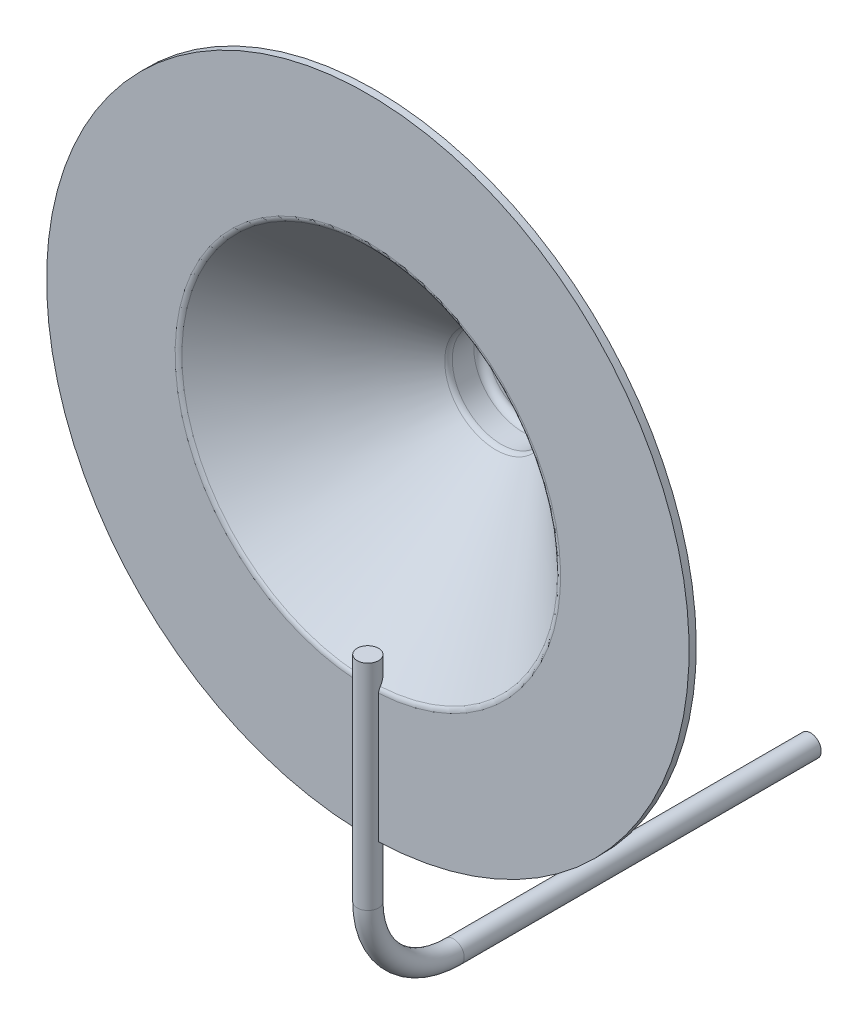
ISO-10303-21;
HEADER;
FILE_DESCRIPTION(('STEP AP214'),'2;1');
FILE_NAME('part.step','',(''),(''),'','','');
FILE_SCHEMA(('AUTOMOTIVE_DESIGN { 1 0 10303 214 1 1 1 1 }'));
ENDSEC;
DATA;
#1=APPLICATION_CONTEXT('core data for automotive mechanical design processes');
#2=APPLICATION_PROTOCOL_DEFINITION('international standard','automotive_design',2000,#1);
#3=PRODUCT_CONTEXT('',#1,'mechanical');
#4=PRODUCT('Part','Part','',(#3));
#5=PRODUCT_RELATED_PRODUCT_CATEGORY('part','',(#4));
#6=PRODUCT_DEFINITION_FORMATION('','',#4);
#7=PRODUCT_DEFINITION_CONTEXT('part definition',#1,'design');
#8=PRODUCT_DEFINITION('design','',#6,#7);
#9=PRODUCT_DEFINITION_SHAPE('','',#8);
#10=(LENGTH_UNIT() NAMED_UNIT(*) SI_UNIT(.MILLI.,.METRE.));
#11=(NAMED_UNIT(*) PLANE_ANGLE_UNIT() SI_UNIT($,.RADIAN.));
#12=(NAMED_UNIT(*) SI_UNIT($,.STERADIAN.) SOLID_ANGLE_UNIT());
#13=UNCERTAINTY_MEASURE_WITH_UNIT(LENGTH_MEASURE(1.E-05),#10,'distance_accuracy_value','');
#14=(GEOMETRIC_REPRESENTATION_CONTEXT(3) GLOBAL_UNCERTAINTY_ASSIGNED_CONTEXT((#13)) GLOBAL_UNIT_ASSIGNED_CONTEXT((#10,
#11,#12)) REPRESENTATION_CONTEXT('',''));
#15=CARTESIAN_POINT('',(0.,0.,0.));
#16=DIRECTION('',(0.,0.,1.));
#17=DIRECTION('',(1.,0.,0.));
#18=AXIS2_PLACEMENT_3D('',#15,#16,#17);
#19=CARTESIAN_POINT('',(0.,-5.3,6.19999999999999));
#20=DIRECTION('',(0.,1.,0.));
#21=DIRECTION('',(0.,0.,1.));
#22=AXIS2_PLACEMENT_3D('',#19,#20,#21);
#23=CYLINDRICAL_SURFACE('',#22,0.15);
#24=CARTESIAN_POINT('',(0.,-4.5,6.34999999999999));
#25=CARTESIAN_POINT('',(0.00842305578923469,-4.4999999663489,6.34999962724313));
#26=CARTESIAN_POINT('',(0.0168521595123221,-4.49997609706395,6.34928813968072));
#27=CARTESIAN_POINT('',(0.0334780529122563,-4.49988317240277,6.34645984425193));
#28=CARTESIAN_POINT('',(0.0416745534213969,-4.49981406314987,6.34434136073797));
#29=CARTESIAN_POINT('',(0.0575919781000059,-4.49963848440692,6.33875960317438));
#30=CARTESIAN_POINT('',(0.0653131340412636,-4.4995320332966,6.33529699061854));
#31=CARTESIAN_POINT('',(0.0800624366854199,-4.49929377585201,6.32712622374));
#32=CARTESIAN_POINT('',(0.0870907512542427,-4.49916197568241,6.32241837214475));
#33=CARTESIAN_POINT('',(0.100260735292938,-4.49888778082419,6.3118878815052));
#34=CARTESIAN_POINT('',(0.106402003146471,-4.49874538138061,6.30606474026404));
#35=CARTESIAN_POINT('',(0.117620176399931,-4.49846607902012,6.29346987595953));
#36=CARTESIAN_POINT('',(0.122697039268723,-4.49832917632302,6.28669811500959));
#37=CARTESIAN_POINT('',(0.131643038257708,-4.49807627946864,6.27239658938628));
#38=CARTESIAN_POINT('',(0.135511915044493,-4.49796028980329,6.26486666240621));
#39=CARTESIAN_POINT('',(0.14193043803754,-4.49776234602747,6.24926370478984));
#40=CARTESIAN_POINT('',(0.144480090156492,-4.49768039176448,6.24119067658788));
#41=CARTESIAN_POINT('',(0.14818687531237,-4.49755979665162,6.22473388130418));
#42=CARTESIAN_POINT('',(0.149344529609131,-4.49752113958868,6.21635023175352));
#43=CARTESIAN_POINT('',(0.150236063891772,-4.49749144895794,6.19950751076078));
#44=CARTESIAN_POINT('',(0.149969950293232,-4.49750041517554,6.19104843965873));
#45=CARTESIAN_POINT('',(0.148021941870991,-4.49756494491055,6.17429853427805));
#46=CARTESIAN_POINT('',(0.146340610333705,-4.4976204898886,6.16600763440809));
#47=CARTESIAN_POINT('',(0.141610764489337,-4.49777188653597,6.14982582985754));
#48=CARTESIAN_POINT('',(0.138562246806203,-4.49786773830482,6.14193492616472));
#49=CARTESIAN_POINT('',(0.131183918840239,-4.4980889649087,6.12677529463673));
#50=CARTESIAN_POINT('',(0.126853850547168,-4.49821434568766,6.11950669246771));
#51=CARTESIAN_POINT('',(0.117035527130669,-4.49848049027993,6.10579937101495));
#52=CARTESIAN_POINT('',(0.111547268631008,-4.49862125413808,6.09936065415049));
#53=CARTESIAN_POINT('',(0.0995651710942693,-4.49890237949121,6.0874925940333));
#54=CARTESIAN_POINT('',(0.0930708437376427,-4.49904274075692,6.08206374377458));
#55=CARTESIAN_POINT('',(0.0792626805756575,-4.4993071722234,6.07237331847266));
#56=CARTESIAN_POINT('',(0.0719488446300602,-4.4994312424214,6.06811174362922));
#57=CARTESIAN_POINT('',(0.0567090019492417,-4.49964910828733,6.06087689403778));
#58=CARTESIAN_POINT('',(0.0487829877417193,-4.49974290358567,6.057903635018));
#59=CARTESIAN_POINT('',(0.0325439037182619,-4.49988964095379,6.05333013301318));
#60=CARTESIAN_POINT('',(0.0242308351991917,-4.49994258316045,6.05172988542808));
#61=CARTESIAN_POINT('',(0.0074579041642934,-4.50000162910169,6.04994843615438));
#62=CARTESIAN_POINT('',(-0.00100188582888631,-4.50000775535074,6.04976655235354));
#63=CARTESIAN_POINT('',(-0.017831878784369,-4.49997253847829,6.05082521577816));
#64=CARTESIAN_POINT('',(-0.0262020818758181,-4.49993119542525,6.05206576095279));
#65=CARTESIAN_POINT('',(-0.0426133978818143,-4.49980571349223,6.05593350317637));
#66=CARTESIAN_POINT('',(-0.0506545839209891,-4.49972158417803,6.05856039028469));
#67=CARTESIAN_POINT('',(-0.0661818515011233,-4.49952000872159,6.06512593405327));
#68=CARTESIAN_POINT('',(-0.0736679316506717,-4.49940256249584,6.06906459400146));
#69=CARTESIAN_POINT('',(-0.087875623242016,-4.49914752515382,6.0781436342119));
#70=CARTESIAN_POINT('',(-0.0945969413405672,-4.49900992635351,6.08328447330488));
#71=CARTESIAN_POINT('',(-0.10708136842188,-4.49873011542475,6.0946212688419));
#72=CARTESIAN_POINT('',(-0.112844474470415,-4.49858790328218,6.10081722851679));
#73=CARTESIAN_POINT('',(-0.123251164011961,-4.49831483319105,6.11409130895656));
#74=CARTESIAN_POINT('',(-0.127894307221744,-4.49818397972076,6.1211697750017));
#75=CARTESIAN_POINT('',(-0.135926259433925,-4.49794845086808,6.13600617727003));
#76=CARTESIAN_POINT('',(-0.139315071611855,-4.49784377541943,6.14376411177297));
#77=CARTESIAN_POINT('',(-0.144741394651816,-4.4976724367805,6.15973757748002));
#78=CARTESIAN_POINT('',(-0.146779189838392,-4.49760576559255,6.16795301200747));
#79=CARTESIAN_POINT('',(-0.149446565063327,-4.49751793017976,6.18460963843641));
#80=CARTESIAN_POINT('',(-0.150076147229453,-4.49749676588617,6.19305082999678));
#81=CARTESIAN_POINT('',(-0.149909192637936,-4.49750233338375,6.20991495508831));
#82=CARTESIAN_POINT('',(-0.149113349841437,-4.4975290418683,6.21833789550626));
#83=CARTESIAN_POINT('',(-0.146119564957647,-4.49762729507843,6.23493053810348));
#84=CARTESIAN_POINT('',(-0.143921620102458,-4.49769883989251,6.2431002397828));
#85=CARTESIAN_POINT('',(-0.138186130366784,-4.49787869671532,6.25895473131229));
#86=CARTESIAN_POINT('',(-0.134648564184163,-4.49798700930871,6.26663951344918));
#87=CARTESIAN_POINT('',(-0.126334454498309,-4.49822818732174,6.28130596285721));
#88=CARTESIAN_POINT('',(-0.121557954901244,-4.49836105187125,6.28828765503276));
#89=CARTESIAN_POINT('',(-0.110899391645607,-4.49863642406369,6.30135301056789));
#90=CARTESIAN_POINT('',(-0.105016908489365,-4.49877893535246,6.30743633160847));
#91=CARTESIAN_POINT('',(-0.0923124370152846,-4.49905753400846,6.31853076644203));
#92=CARTESIAN_POINT('',(-0.0854902166260294,-4.49919361977771,6.32354161460101));
#93=CARTESIAN_POINT('',(-0.0710969086078195,-4.49944408112954,6.33234990985486));
#94=CARTESIAN_POINT('',(-0.0635253084790552,-4.49955844169603,6.33614651891896));
#95=CARTESIAN_POINT('',(-0.047857599747668,-4.4997523012651,6.34241020428075));
#96=CARTESIAN_POINT('',(-0.039762128777033,-4.49983184176597,6.34487886402614));
#97=CARTESIAN_POINT('',(-0.0263463576588846,-4.49992586926896,6.3477632370994));
#98=CARTESIAN_POINT('',(-0.0211131135613521,-4.49995354747019,6.34860096573659));
#99=CARTESIAN_POINT('',(-0.0105873762627153,-4.49999062340921,6.34971946424585));
#100=CARTESIAN_POINT('',(-0.0052948830832799,-4.50000002115368,6.35000023432161));
#101=CARTESIAN_POINT('',(0.,-4.5,6.34999999999999));
#102=B_SPLINE_CURVE_WITH_KNOTS('',3,(#24,#25,#26,#27,#28,#29,#30,#31,#32,#33,#34,#35,#36,#37,
#38,#39,#40,#41,#42,#43,#44,#45,#46,#47,#48,#49,#50,#51,#52,#53,#54,#55,#56,#57,#58,#59,#60,#61,
#62,#63,#64,#65,#66,#67,#68,#69,#70,#71,#72,#73,#74,#75,#76,#77,#78,#79,#80,#81,#82,#83,#84,#85,
#86,#87,#88,#89,#90,#91,#92,#93,#94,#95,#96,#97,#98,#99,#100,#101),.UNSPECIFIED.,.T.,.F.,(4,2,2,
2,2,2,2,2,2,2,2,2,2,2,2,2,2,2,2,2,2,2,2,2,2,2,2,2,2,2,2,2,2,2,2,2,2,2,4),(0.,0.0252498401882614,
0.050529805470018,0.075797345320868,0.10105874807005,0.126331552476644,0.151605366533064,
0.17688460270899,0.202163725583854,0.227433379263464,0.252702919076677,0.277962405836567,
0.303221954971138,0.328486592988428,0.353751304655501,0.37902831779896,0.404305335267964,
0.429582661319222,0.454859902682321,0.480124987094063,0.505390035079432,0.530649437018977,
0.555908902270803,0.581178023978172,0.606447223062961,0.631726339921331,0.657005392781315,
0.682279123917965,0.707552816866738,0.73281420878652,0.758075650575135,0.783337494078242,
0.808598442457161,0.833868991671109,0.859145792761928,0.884440001670267,0.909703982510625,
0.925576488155589,0.941448987995756),.UNSPECIFIED.);
#103=CARTESIAN_POINT('',(0.15,-4.49749930516948,6.19999999999999));
#104=VERTEX_POINT('',#103);
#105=CARTESIAN_POINT('',(0.11180339887499,-4.49861089671023,6.09999999999999));
#106=VERTEX_POINT('',#105);
#107=EDGE_CURVE('E11',#104,#106,#102,.T.);
#108=ORIENTED_EDGE('',*,*,#107,.F.);
#109=DIRECTION('',(0.,1.,0.));
#110=VECTOR('',#109,1.);
#111=CARTESIAN_POINT('',(0.15,-5.3,6.19999999999999));
#112=LINE('',#111,#110);
#113=CARTESIAN_POINT('',(0.15,-2.69583011334171,6.19999999999999));
#114=VERTEX_POINT('',#113);
#115=EDGE_CURVE('E169',#114,#104,#112,.F.);
#116=ORIENTED_EDGE('',*,*,#115,.F.);
#117=CARTESIAN_POINT('',(0.147592454675923,-2.62776349245829,6.17323309276857));
#118=CARTESIAN_POINT('',(0.148260648346117,-2.63170876049585,6.17693871212926));
#119=CARTESIAN_POINT('',(0.148732730797178,-2.63598076420099,6.18031677264153));
#120=CARTESIAN_POINT('',(0.149407771591125,-2.64503045876261,6.18633296389364));
#121=CARTESIAN_POINT('',(0.149611056526367,-2.64980752831836,6.18897198949));
#122=CARTESIAN_POINT('',(0.149872484898582,-2.65972453716036,6.19343231181264));
#123=CARTESIAN_POINT('',(0.14993078378246,-2.66486408173148,6.19525448261004));
#124=CARTESIAN_POINT('',(0.149994260827242,-2.67536514778347,6.19803975796262));
#125=CARTESIAN_POINT('',(0.149999498326573,-2.68072641457174,6.19900382103654));
#126=CARTESIAN_POINT('',(0.14999905964575,-2.69080390358621,6.19998491550968));
#127=CARTESIAN_POINT('',(0.149994759754331,-2.6955096331253,6.20011211012248));
#128=CARTESIAN_POINT('',(0.149999969770463,-2.70019999999998,6.19990476939652));
#129=B_SPLINE_CURVE_WITH_KNOTS('',3,(#117,#118,#119,#120,#121,#122,#123,#124,#125,#126,#127,
#128),.UNSPECIFIED.,.F.,.F.,(4,2,2,2,2,4),(0.,0.0163247398510532,0.0326296266565771,
0.0489170246143126,0.0651862063980188,0.0792617964111007),.UNSPECIFIED.);
#130=CARTESIAN_POINT('',(0.147628586120579,-2.62797752969163,6.17343309275925));
#131=VERTEX_POINT('',#130);
#132=EDGE_CURVE('E99',#131,#114,#129,.T.);
#133=ORIENTED_EDGE('',*,*,#132,.F.);
#134=CARTESIAN_POINT('',(-0.149343023608144,-2.64147205449942,6.18597640204592));
#135=CARTESIAN_POINT('',(-0.148257481932023,-2.6293126941027,6.17470378552663));
#136=CARTESIAN_POINT('',(-0.145924349391535,-2.61717578070323,6.16337591005817));
#137=CARTESIAN_POINT('',(-0.138413604644136,-2.59330106192299,6.14095791068932));
#138=CARTESIAN_POINT('',(-0.133201282196265,-2.58157002082887,6.12987243904061));
#139=CARTESIAN_POINT('',(-0.122214890865073,-2.56349726305133,6.11268879442249));
#140=CARTESIAN_POINT('',(-0.117430635767246,-2.55682024285901,6.10631438866371));
#141=CARTESIAN_POINT('',(-0.106559085727574,-2.54408705358876,6.09411455684));
#142=CARTESIAN_POINT('',(-0.100476784108048,-2.53802863332228,6.08828714690919));
#143=CARTESIAN_POINT('',(-0.0884561028701566,-2.52806386760671,6.07867158351688));
#144=CARTESIAN_POINT('',(-0.0827962257170654,-2.52398067630688,6.074720283253));
#145=CARTESIAN_POINT('',(-0.0706378081625269,-2.51652007570977,6.0674852296196));
#146=CARTESIAN_POINT('',(-0.0641401048358653,-2.51314197066332,6.06420081828029));
#147=CARTESIAN_POINT('',(-0.0517121985635129,-2.50787089745336,6.05906771247288));
#148=CARTESIAN_POINT('',(-0.045914753206457,-2.50581710542551,6.05706424392605));
#149=CARTESIAN_POINT('',(-0.0339226162333526,-2.50242685283714,6.05375416162696));
#150=CARTESIAN_POINT('',(-0.0277282054880401,-2.50108989122568,6.05244706113064));
#151=CARTESIAN_POINT('',(-0.0150685123783346,-2.49922299819053,6.05062122672329));
#152=CARTESIAN_POINT('',(-0.00860198324392683,-2.49869732229806,6.05010664995781));
#153=CARTESIAN_POINT('',(0.0043552042929747,-2.49851008555425,6.04992341008355));
#154=CARTESIAN_POINT('',(0.0108458577842335,-2.49884835751308,6.05025458330658));
#155=CARTESIAN_POINT('',(0.0230965213498389,-2.50029657615518,6.05167128236637));
#156=CARTESIAN_POINT('',(0.0288723596648218,-2.50133990354351,6.05269168090871));
#157=CARTESIAN_POINT('',(0.0401225562490682,-2.50406087653368,6.05534992888236));
#158=CARTESIAN_POINT('',(0.0455968040067812,-2.50573875290475,6.05698800294581));
#159=CARTESIAN_POINT('',(0.0577859507705718,-2.51024683640637,6.06138279622013));
#160=CARTESIAN_POINT('',(0.0643600443709466,-2.51327298721011,6.06432884436633));
#161=CARTESIAN_POINT('',(0.0767312206122429,-2.52005937010196,6.07091984656736));
#162=CARTESIAN_POINT('',(0.0825269686642201,-2.52382083655722,6.0745659756554));
#163=CARTESIAN_POINT('',(0.0953128577493477,-2.53338966874653,6.08381650566497));
#164=CARTESIAN_POINT('',(0.101956015546936,-2.53944014691157,6.0896473901399));
#165=CARTESIAN_POINT('',(0.113829633985528,-2.55224532787521,6.10193822839228));
#166=CARTESIAN_POINT('',(0.119057041563311,-2.55900150975549,6.10839950145204));
#167=CARTESIAN_POINT('',(0.130091438750021,-2.57586415646814,6.12445942409624));
#168=CARTESIAN_POINT('',(0.135251517330301,-2.58620508054889,6.13425486143364));
#169=CARTESIAN_POINT('',(0.143241265130115,-2.60738729889181,6.1542024557933));
#170=CARTESIAN_POINT('',(0.146072116816615,-2.61822833630815,6.1643544290819));
#171=CARTESIAN_POINT('',(0.148479886629033,-2.6332650908433,6.17835730655679));
#172=CARTESIAN_POINT('',(0.148984086060253,-2.63736443883716,6.18216696640583));
#173=CARTESIAN_POINT('',(0.149343023608145,-2.64147205449942,6.18597640204592));
#174=B_SPLINE_CURVE_WITH_KNOTS('',3,(#134,#135,#136,#137,#138,#139,#140,#141,#142,#143,#144,
#145,#146,#147,#148,#149,#150,#151,#152,#153,#154,#155,#156,#157,#158,#159,#160,#161,#162,#163,
#164,#165,#166,#167,#168,#169,#170,#171,#172,#173),.UNSPECIFIED.,.F.,.F.,(4,2,2,2,2,2,2,2,2,2,2,
2,2,2,2,2,2,2,2,4),(0.,0.0499716216561541,0.100559259111792,0.131660210852275,0.16264361324885,
0.186620377425872,0.210573369315285,0.229900322083233,0.249213748005489,0.268628140650761,
0.288038776538047,0.305832704342108,0.323633109574702,0.346946114899063,0.370298596911756,
0.402257222718973,0.434284228194368,0.479492414055909,0.524677635118706,0.541524840105466),.UNSPECIFIED.);
#175=CARTESIAN_POINT('',(-0.147628586121588,-2.62797752969785,6.17343309276838));
#176=VERTEX_POINT('',#175);
#177=EDGE_CURVE('E81',#176,#131,#174,.T.);
#178=ORIENTED_EDGE('',*,*,#177,.F.);
#179=CARTESIAN_POINT('',(-0.149999969770437,-2.7002,6.1999047693963));
#180=CARTESIAN_POINT('',(-0.149990932883973,-2.69459886091882,6.20015359116287));
#181=CARTESIAN_POINT('',(-0.149999141454605,-2.68897782076842,6.19992387525168));
#182=CARTESIAN_POINT('',(-0.149996889947737,-2.67783887890871,6.19853191549922));
#183=CARTESIAN_POINT('',(-0.149986386181456,-2.67232124903959,6.19736749283208));
#184=CARTESIAN_POINT('',(-0.149893045233185,-2.66155402033728,6.19412802925226));
#185=CARTESIAN_POINT('',(-0.149810131460046,-2.65630471154398,6.1920520252776));
#186=CARTESIAN_POINT('',(-0.149461146474099,-2.64624959978622,6.18705056052545));
#187=CARTESIAN_POINT('',(-0.149195620633867,-2.64144252442324,6.18412764406092));
#188=CARTESIAN_POINT('',(-0.148466854008081,-2.63371541053077,6.17848134865159));
#189=CARTESIAN_POINT('',(-0.14808266301025,-2.63065083520647,6.17594329735243));
#190=CARTESIAN_POINT('',(-0.147592454676046,-2.6277634924584,6.17323309276841));
#191=B_SPLINE_CURVE_WITH_KNOTS('',3,(#179,#180,#181,#182,#183,#184,#185,#186,#187,#188,#189,
#190),.UNSPECIFIED.,.F.,.F.,(4,2,2,2,2,4),(0.,0.0167987571364454,0.0336367867239368,
0.0504926482137955,0.0672983868876986,0.079260042560122),.UNSPECIFIED.);
#192=CARTESIAN_POINT('',(-0.15,-2.69583011334171,6.19999999999999));
#193=VERTEX_POINT('',#192);
#194=EDGE_CURVE('E75',#193,#176,#191,.T.);
#195=ORIENTED_EDGE('',*,*,#194,.F.);
#196=DIRECTION('',(0.,1.,0.));
#197=VECTOR('',#196,1.);
#198=CARTESIAN_POINT('',(-0.15,-5.3,6.19999999999999));
#199=LINE('',#198,#197);
#200=CARTESIAN_POINT('',(-0.15,-4.49749930516948,6.19999999999999));
#201=VERTEX_POINT('',#200);
#202=EDGE_CURVE('E78',#201,#193,#199,.T.);
#203=ORIENTED_EDGE('',*,*,#202,.F.);
#204=CARTESIAN_POINT('',(-0.111803398874994,-4.49861089671023,6.09999999999999));
#205=VERTEX_POINT('',#204);
#206=EDGE_CURVE('E42',#205,#201,#102,.T.);
#207=ORIENTED_EDGE('',*,*,#206,.F.);
#208=DIRECTION('',(0.,1.,0.));
#209=VECTOR('',#208,1.);
#210=CARTESIAN_POINT('',(-0.11180339887499,-5.3,6.09999999999999));
#211=LINE('',#210,#209);
#212=CARTESIAN_POINT('',(-0.11180339887499,-2.69768419204324,6.09999999999999));
#213=VERTEX_POINT('',#212);
#214=EDGE_CURVE('E163',#213,#205,#211,.F.);
#215=ORIENTED_EDGE('',*,*,#214,.F.);
#216=CARTESIAN_POINT('',(0.116245257967799,-2.70312711771821,6.10519999999999));
#217=CARTESIAN_POINT('',(0.111508410263343,-2.69704335282468,6.09939457031248));
#218=CARTESIAN_POINT('',(0.106191207346347,-2.691163531819,6.09376248858668));
#219=CARTESIAN_POINT('',(0.0942959076086731,-2.68003005930324,6.08306732653731));
#220=CARTESIAN_POINT('',(0.0877046148167213,-2.67478398699131,6.07801116825454));
#221=CARTESIAN_POINT('',(0.0751315014855339,-2.66651149182841,6.07001783184854));
#222=CARTESIAN_POINT('',(0.0694332537194209,-2.66326196324069,6.06687088110914));
#223=CARTESIAN_POINT('',(0.0573997587510783,-2.65747591706972,6.06125895065075));
#224=CARTESIAN_POINT('',(0.0510672445068236,-2.65493650520729,6.05879120331676));
#225=CARTESIAN_POINT('',(0.0388320611657511,-2.65103264869694,6.05499359000535));
#226=CARTESIAN_POINT('',(0.0330027291344942,-2.64955045247115,6.0535498719421));
#227=CARTESIAN_POINT('',(0.021074431392455,-2.64730765434864,6.05136427494578));
#228=CARTESIAN_POINT('',(0.0149754375026845,-2.64654712805202,6.05062246954313));
#229=CARTESIAN_POINT('',(0.00266989156005454,-2.64580324885016,6.04989690918266));
#230=CARTESIAN_POINT('',(-0.00353687969067115,-2.64582172766907,6.04991494087798));
#231=CARTESIAN_POINT('',(-0.015848189742385,-2.64663894358602,6.05071201576891));
#232=CARTESIAN_POINT('',(-0.0219527237053316,-2.64743771750341,6.05149109487567));
#233=CARTESIAN_POINT('',(-0.0336597450694292,-2.64971327505532,6.05370846116419));
#234=CARTESIAN_POINT('',(-0.0392724785801995,-2.65116344473811,6.05512086894645));
#235=CARTESIAN_POINT('',(-0.0501306165698138,-2.6546478257337,6.05851033630297));
#236=CARTESIAN_POINT('',(-0.0553759220625383,-2.65668219368413,6.06048754731384));
#237=CARTESIAN_POINT('',(-0.0674871845655642,-2.66217315474118,6.06581615390628));
#238=CARTESIAN_POINT('',(-0.0741416537037785,-2.66587140606292,6.06939912195071));
#239=CARTESIAN_POINT('',(-0.0865394058070578,-2.67400636419898,6.07726000408673));
#240=CARTESIAN_POINT('',(-0.0922799355042373,-2.67844522282048,6.08153994230436));
#241=CARTESIAN_POINT('',(-0.101081003097445,-2.68628348159451,6.08907622120694));
#242=CARTESIAN_POINT('',(-0.104396066464006,-2.68953454407121,6.09219667091797));
#243=CARTESIAN_POINT('',(-0.110615189482238,-2.69620826438898,6.09859013212888));
#244=CARTESIAN_POINT('',(-0.113522001896369,-2.6996295389706,6.10186190219225));
#245=CARTESIAN_POINT('',(-0.116245257968039,-2.70312711771808,6.10519999999986));
#246=B_SPLINE_CURVE_WITH_KNOTS('',3,(#216,#217,#218,#219,#220,#221,#222,#223,#224,#225,#226,
#227,#228,#229,#230,#231,#232,#233,#234,#235,#236,#237,#238,#239,#240,#241,#242,#243,#244,#245),
.UNSPECIFIED.,.F.,.F.,(4,2,2,2,2,2,2,2,2,2,2,2,2,2,4),(0.,0.0290176757476346,0.0583537728358914,
0.0800994022780507,0.101755064739514,0.120232113360398,0.138711097371111,0.157233534607547,
0.175756845894448,0.193583893706585,0.211415725849439,0.23651998873098,0.261698503529203,
0.278463009586152,0.295108407104796),.UNSPECIFIED.);
#247=CARTESIAN_POINT('',(0.111803398875002,-2.69768419204324,6.1));
#248=VERTEX_POINT('',#247);
#249=EDGE_CURVE('E52',#248,#213,#246,.T.);
#250=ORIENTED_EDGE('',*,*,#249,.F.);
#251=DIRECTION('',(0.,1.,0.));
#252=VECTOR('',#251,1.);
#253=CARTESIAN_POINT('',(0.11180339887499,-5.3,6.09999999999999));
#254=LINE('',#253,#252);
#255=EDGE_CURVE('E36',#106,#248,#254,.T.);
#256=ORIENTED_EDGE('',*,*,#255,.F.);
#257=EDGE_LOOP('',(#108,#116,#133,#178,#195,#203,#207,#215,#250,#256));
#258=FACE_BOUND('',#257,.T.);
#259=CARTESIAN_POINT('',(0.,-5.3,6.19999999999999));
#260=DIRECTION('',(0.,1.,0.));
#261=DIRECTION('',(1.,0.,0.));
#262=AXIS2_PLACEMENT_3D('',#259,#260,#261);
#263=CIRCLE('',#262,0.15);
#264=CARTESIAN_POINT('',(0.,-5.3,6.34999999999999));
#265=VERTEX_POINT('',#264);
#266=EDGE_CURVE('E136',#265,#265,#263,.T.);
#267=ORIENTED_EDGE('',*,*,#266,.T.);
#268=EDGE_LOOP('',(#267));
#269=FACE_BOUND('',#268,.T.);
#270=CARTESIAN_POINT('',(0.,-2.3,6.19999999999999));
#271=DIRECTION('',(0.,1.,0.));
#272=DIRECTION('',(1.,0.,0.));
#273=AXIS2_PLACEMENT_3D('',#270,#271,#272);
#274=CIRCLE('',#273,0.15);
#275=CARTESIAN_POINT('',(0.15,-2.3,6.19999999999999));
#276=VERTEX_POINT('',#275);
#277=EDGE_CURVE('E95',#276,#276,#274,.T.);
#278=ORIENTED_EDGE('',*,*,#277,.F.);
#279=EDGE_LOOP('',(#278));
#280=FACE_BOUND('',#279,.T.);
#281=ADVANCED_FACE('F32',(#258,#269,#280),#23,.T.);
#282=CARTESIAN_POINT('',(0.,-5.3,4.99999999999999));
#283=DIRECTION('',(-1.,0.,0.));
#284=DIRECTION('',(0.,0.,1.));
#285=AXIS2_PLACEMENT_3D('',#282,#283,#284);
#286=TOROIDAL_SURFACE('',#285,1.2,0.15);
#287=CARTESIAN_POINT('',(0.,-6.5,4.99999999999999));
#288=DIRECTION('',(0.,0.,1.));
#289=DIRECTION('',(1.,0.,0.));
#290=AXIS2_PLACEMENT_3D('',#287,#288,#289);
#291=CIRCLE('',#290,0.15);
#292=CARTESIAN_POINT('',(0.,-6.65,4.99999999999999));
#293=VERTEX_POINT('',#292);
#294=EDGE_CURVE('E133',#293,#293,#291,.T.);
#295=CARTESIAN_POINT('',(0.,-5.3,4.99999999999999));
#296=DIRECTION('',(-1.,0.,0.));
#297=DIRECTION('',(0.,0.,1.));
#298=AXIS2_PLACEMENT_3D('',#295,#296,#297);
#299=CIRCLE('',#298,1.35);
#300=EDGE_CURVE('',#293,#265,#299,.T.);
#301=ORIENTED_EDGE('',*,*,#294,.T.);
#302=ORIENTED_EDGE('',*,*,#266,.F.);
#303=ORIENTED_EDGE('',*,*,#300,.T.);
#304=ORIENTED_EDGE('',*,*,#300,.F.);
#305=EDGE_LOOP('',(#301,#303,#302,#304));
#306=FACE_BOUND('',#305,.T.);
#307=ADVANCED_FACE('F200',(#306),#286,.T.);
#308=CARTESIAN_POINT('',(0.,-6.5,4.99999999999999));
#309=DIRECTION('',(0.,0.,-1.));
#310=DIRECTION('',(-1.,0.,0.));
#311=AXIS2_PLACEMENT_3D('',#308,#309,#310);
#312=CYLINDRICAL_SURFACE('',#311,0.15);
#313=ORIENTED_EDGE('',*,*,#294,.F.);
#314=EDGE_LOOP('',(#313));
#315=FACE_BOUND('',#314,.T.);
#316=CARTESIAN_POINT('',(0.,-6.5,0.));
#317=DIRECTION('',(0.,0.,1.));
#318=DIRECTION('',(1.,0.,0.));
#319=AXIS2_PLACEMENT_3D('',#316,#317,#318);
#320=CIRCLE('',#319,0.15);
#321=CARTESIAN_POINT('',(0.15,-6.5,0.));
#322=VERTEX_POINT('',#321);
#323=EDGE_CURVE('E132',#322,#322,#320,.T.);
#324=ORIENTED_EDGE('',*,*,#323,.T.);
#325=EDGE_LOOP('',(#324));
#326=FACE_BOUND('',#325,.T.);
#327=ADVANCED_FACE('F194',(#315,#326),#312,.T.);
#328=CARTESIAN_POINT('',(0.,-2.3,6.19999999999999));
#329=DIRECTION('',(0.,1.,0.));
#330=DIRECTION('',(1.,0.,0.));
#331=AXIS2_PLACEMENT_3D('',#328,#329,#330);
#332=PLANE('',#331);
#333=ORIENTED_EDGE('',*,*,#277,.T.);
#334=EDGE_LOOP('',(#333));
#335=FACE_BOUND('',#334,.T.);
#336=ADVANCED_FACE('F191',(#335),#332,.T.);
#337=CARTESIAN_POINT('',(0.,-6.5,0.));
#338=DIRECTION('',(0.,0.,1.));
#339=DIRECTION('',(1.,0.,0.));
#340=AXIS2_PLACEMENT_3D('',#337,#338,#339);
#341=PLANE('',#340);
#342=ORIENTED_EDGE('',*,*,#323,.F.);
#343=EDGE_LOOP('',(#342));
#344=FACE_BOUND('',#343,.T.);
#345=ADVANCED_FACE('F189',(#344),#341,.F.);
#346=CARTESIAN_POINT('',(0.,0.,6.19999999999999));
#347=DIRECTION('',(0.,0.,1.));
#348=DIRECTION('',(1.,0.,0.));
#349=AXIS2_PLACEMENT_3D('',#346,#347,#348);
#350=CYLINDRICAL_SURFACE('',#349,4.5);
#351=CARTESIAN_POINT('',(0.,0.,6.19999999999999));
#352=DIRECTION('',(0.,0.,1.));
#353=DIRECTION('',(1.,0.,0.));
#354=AXIS2_PLACEMENT_3D('',#351,#352,#353);
#355=CIRCLE('',#354,4.5);
#356=EDGE_CURVE('E94',#104,#201,#355,.T.);
#357=ORIENTED_EDGE('',*,*,#356,.F.);
#358=ORIENTED_EDGE('',*,*,#107,.T.);
#359=CARTESIAN_POINT('',(0.,0.,6.09999999999999));
#360=DIRECTION('',(0.,0.,1.));
#361=DIRECTION('',(1.,0.,0.));
#362=AXIS2_PLACEMENT_3D('',#359,#360,#361);
#363=CIRCLE('',#362,4.5);
#364=EDGE_CURVE('E129',#106,#205,#363,.T.);
#365=ORIENTED_EDGE('',*,*,#364,.T.);
#366=ORIENTED_EDGE('',*,*,#206,.T.);
#367=EDGE_LOOP('',(#357,#358,#365,#366));
#368=FACE_BOUND('',#367,.T.);
#369=ADVANCED_FACE('F184',(#368),#350,.T.);
#370=CARTESIAN_POINT('',(0.,-4.5,6.09999999999999));
#371=DIRECTION('',(0.,0.,-1.));
#372=DIRECTION('',(-1.,0.,0.));
#373=AXIS2_PLACEMENT_3D('',#370,#371,#372);
#374=PLANE('',#373);
#375=CARTESIAN_POINT('',(0.,0.,6.09999999999999));
#376=DIRECTION('',(0.,0.,1.));
#377=DIRECTION('',(1.,0.,0.));
#378=AXIS2_PLACEMENT_3D('',#375,#376,#377);
#379=CIRCLE('',#378,2.7);
#380=EDGE_CURVE('E126',#248,#213,#379,.T.);
#381=ORIENTED_EDGE('',*,*,#380,.T.);
#382=ORIENTED_EDGE('',*,*,#214,.T.);
#383=ORIENTED_EDGE('',*,*,#364,.F.);
#384=ORIENTED_EDGE('',*,*,#255,.T.);
#385=EDGE_LOOP('',(#381,#382,#383,#384));
#386=FACE_BOUND('',#385,.T.);
#387=ADVANCED_FACE('F180',(#386),#374,.T.);
#388=CARTESIAN_POINT('',(0.,0.,6.09999999999999));
#389=DIRECTION('',(0.,0.,1.));
#390=DIRECTION('',(1.,0.,0.));
#391=AXIS2_PLACEMENT_3D('',#388,#389,#390);
#392=CONICAL_SURFACE('',#391,2.7,0.824680473301762);
#393=CARTESIAN_POINT('',(0.,0.,4.33124086177751));
#394=DIRECTION('',(0.,0.,1.));
#395=DIRECTION('',(1.,0.,0.));
#396=AXIS2_PLACEMENT_3D('',#393,#394,#395);
#397=CIRCLE('',#396,0.786519537148031);
#398=CARTESIAN_POINT('',(0.786519537148031,0.,4.33124086177751));
#399=VERTEX_POINT('',#398);
#400=EDGE_CURVE('E123',#399,#399,#397,.T.);
#401=ORIENTED_EDGE('',*,*,#400,.T.);
#402=EDGE_LOOP('',(#401));
#403=FACE_BOUND('',#402,.T.);
#404=ORIENTED_EDGE('',*,*,#380,.F.);
#405=ORIENTED_EDGE('',*,*,#249,.T.);
#406=EDGE_LOOP('',(#404,#405));
#407=FACE_BOUND('',#406,.T.);
#408=ADVANCED_FACE('F174',(#403,#407),#392,.T.);
#409=CARTESIAN_POINT('',(0.,0.,6.19999999999999));
#410=DIRECTION('',(0.,0.,1.));
#411=DIRECTION('',(1.,0.,0.));
#412=AXIS2_PLACEMENT_3D('',#409,#410,#411);
#413=CYLINDRICAL_SURFACE('',#412,0.786519537148031);
#414=CARTESIAN_POINT('',(0.,0.,4.03124086177751));
#415=DIRECTION('',(0.,0.,1.));
#416=DIRECTION('',(1.,0.,0.));
#417=AXIS2_PLACEMENT_3D('',#414,#415,#416);
#418=CIRCLE('',#417,0.786519537148032);
#419=CARTESIAN_POINT('',(0.786519537148032,0.,4.03124086177751));
#420=VERTEX_POINT('',#419);
#421=EDGE_CURVE('E120',#420,#420,#418,.T.);
#422=ORIENTED_EDGE('',*,*,#421,.T.);
#423=EDGE_LOOP('',(#422));
#424=FACE_BOUND('',#423,.T.);
#425=ORIENTED_EDGE('',*,*,#400,.F.);
#426=EDGE_LOOP('',(#425));
#427=FACE_BOUND('',#426,.T.);
#428=ADVANCED_FACE('F179',(#424,#427),#413,.T.);
#429=CARTESIAN_POINT('',(0.,0.,4.03124086177751));
#430=DIRECTION('',(0.,0.,1.));
#431=DIRECTION('',(1.,0.,0.));
#432=AXIS2_PLACEMENT_3D('',#429,#430,#431);
#433=TOROIDAL_SURFACE('',#432,0.586519537148032,0.2);
#434=CARTESIAN_POINT('',(0.,0.,3.83124086177751));
#435=DIRECTION('',(0.,0.,1.));
#436=DIRECTION('',(1.,0.,0.));
#437=AXIS2_PLACEMENT_3D('',#434,#435,#436);
#438=CIRCLE('',#437,0.586519537148031);
#439=CARTESIAN_POINT('',(0.586519537148031,0.,3.83124086177751));
#440=VERTEX_POINT('',#439);
#441=EDGE_CURVE('E117',#440,#440,#438,.T.);
#442=ORIENTED_EDGE('',*,*,#441,.T.);
#443=EDGE_LOOP('',(#442));
#444=FACE_BOUND('',#443,.T.);
#445=ORIENTED_EDGE('',*,*,#421,.F.);
#446=EDGE_LOOP('',(#445));
#447=FACE_BOUND('',#446,.T.);
#448=ADVANCED_FACE('F248',(#444,#447),#433,.T.);
#449=CARTESIAN_POINT('',(0.,-0.586519537148031,3.83124086177751));
#450=DIRECTION('',(0.,0.,-1.));
#451=DIRECTION('',(-1.,0.,0.));
#452=AXIS2_PLACEMENT_3D('',#449,#450,#451);
#453=PLANE('',#452);
#454=ORIENTED_EDGE('',*,*,#441,.F.);
#455=EDGE_LOOP('',(#454));
#456=FACE_BOUND('',#455,.T.);
#457=ADVANCED_FACE('F257',(#456),#453,.T.);
#458=CARTESIAN_POINT('',(0.,-0.586519537148031,3.93124086177751));
#459=DIRECTION('',(0.,0.,1.));
#460=DIRECTION('',(1.,0.,0.));
#461=AXIS2_PLACEMENT_3D('',#458,#459,#460);
#462=PLANE('',#461);
#463=CARTESIAN_POINT('',(0.,0.,3.93124086177751));
#464=DIRECTION('',(0.,0.,1.));
#465=DIRECTION('',(1.,0.,0.));
#466=AXIS2_PLACEMENT_3D('',#463,#464,#465);
#467=CIRCLE('',#466,0.586519537148031);
#468=CARTESIAN_POINT('',(0.586519537148031,0.,3.93124086177751));
#469=VERTEX_POINT('',#468);
#470=EDGE_CURVE('E114',#469,#469,#467,.T.);
#471=ORIENTED_EDGE('',*,*,#470,.T.);
#472=EDGE_LOOP('',(#471));
#473=FACE_BOUND('',#472,.T.);
#474=ADVANCED_FACE('F266',(#473),#462,.T.);
#475=CARTESIAN_POINT('',(0.,0.,4.03124086177751));
#476=DIRECTION('',(0.,0.,1.));
#477=DIRECTION('',(1.,0.,0.));
#478=AXIS2_PLACEMENT_3D('',#475,#476,#477);
#479=TOROIDAL_SURFACE('',#478,0.586519537148032,0.1);
#480=CARTESIAN_POINT('',(0.,0.,4.03124086177751));
#481=DIRECTION('',(0.,0.,1.));
#482=DIRECTION('',(1.,0.,0.));
#483=AXIS2_PLACEMENT_3D('',#480,#481,#482);
#484=CIRCLE('',#483,0.686519537148032);
#485=CARTESIAN_POINT('',(0.686519537148032,0.,4.03124086177751));
#486=VERTEX_POINT('',#485);
#487=EDGE_CURVE('E111',#486,#486,#484,.T.);
#488=ORIENTED_EDGE('',*,*,#487,.T.);
#489=EDGE_LOOP('',(#488));
#490=FACE_BOUND('',#489,.T.);
#491=ORIENTED_EDGE('',*,*,#470,.F.);
#492=EDGE_LOOP('',(#491));
#493=FACE_BOUND('',#492,.T.);
#494=ADVANCED_FACE('F276',(#490,#493),#479,.F.);
#495=CARTESIAN_POINT('',(0.,0.,6.19999999999999));
#496=DIRECTION('',(0.,0.,1.));
#497=DIRECTION('',(1.,0.,0.));
#498=AXIS2_PLACEMENT_3D('',#495,#496,#497);
#499=CYLINDRICAL_SURFACE('',#498,0.686519537148032);
#500=CARTESIAN_POINT('',(0.,0.,4.33124086177751));
#501=DIRECTION('',(0.,0.,1.));
#502=DIRECTION('',(1.,0.,0.));
#503=AXIS2_PLACEMENT_3D('',#500,#501,#502);
#504=CIRCLE('',#503,0.686519537148031);
#505=CARTESIAN_POINT('',(0.686519537148031,0.,4.33124086177751));
#506=VERTEX_POINT('',#505);
#507=EDGE_CURVE('E108',#506,#506,#504,.T.);
#508=ORIENTED_EDGE('',*,*,#507,.T.);
#509=EDGE_LOOP('',(#508));
#510=FACE_BOUND('',#509,.T.);
#511=ORIENTED_EDGE('',*,*,#487,.F.);
#512=EDGE_LOOP('',(#511));
#513=FACE_BOUND('',#512,.T.);
#514=ADVANCED_FACE('F286',(#510,#513),#499,.F.);
#515=CARTESIAN_POINT('',(0.,0.,4.33124086177751));
#516=DIRECTION('',(0.,0.,1.));
#517=DIRECTION('',(1.,0.,0.));
#518=AXIS2_PLACEMENT_3D('',#515,#516,#517);
#519=TOROIDAL_SURFACE('',#518,0.786519537148032,0.1);
#520=CARTESIAN_POINT('',(0.,0.,4.40467395454609));
#521=DIRECTION('',(0.,0.,1.));
#522=DIRECTION('',(1.,0.,0.));
#523=AXIS2_PLACEMENT_3D('',#520,#521,#522);
#524=CIRCLE('',#523,0.718640373287233);
#525=CARTESIAN_POINT('',(0.718640373287233,0.,4.40467395454609));
#526=VERTEX_POINT('',#525);
#527=EDGE_CURVE('E102',#526,#526,#524,.T.);
#528=ORIENTED_EDGE('',*,*,#527,.T.);
#529=EDGE_LOOP('',(#528));
#530=FACE_BOUND('',#529,.T.);
#531=ORIENTED_EDGE('',*,*,#507,.F.);
#532=EDGE_LOOP('',(#531));
#533=FACE_BOUND('',#532,.T.);
#534=ADVANCED_FACE('F296',(#530,#533),#519,.T.);
#535=CARTESIAN_POINT('',(0.,0.,4.40467395454609));
#536=DIRECTION('',(0.,0.,1.));
#537=DIRECTION('',(1.,0.,0.));
#538=AXIS2_PLACEMENT_3D('',#535,#536,#537);
#539=CONICAL_SURFACE('',#538,0.718640373287233,0.824680473301762);
#540=CARTESIAN_POINT('',(0.,0.,6.17343309276857));
#541=DIRECTION('',(0.,0.,1.));
#542=DIRECTION('',(1.,0.,0.));
#543=AXIS2_PLACEMENT_3D('',#540,#541,#542);
#544=CIRCLE('',#543,2.6321208361392);
#545=EDGE_CURVE('E100',#131,#176,#544,.T.);
#546=ORIENTED_EDGE('',*,*,#545,.T.);
#547=ORIENTED_EDGE('',*,*,#177,.T.);
#548=EDGE_LOOP('',(#546,#547));
#549=FACE_BOUND('',#548,.T.);
#550=ORIENTED_EDGE('',*,*,#527,.F.);
#551=EDGE_LOOP('',(#550));
#552=FACE_BOUND('',#551,.T.);
#553=ADVANCED_FACE('F154',(#549,#552),#539,.F.);
#554=CARTESIAN_POINT('',(0.,0.,6.09999999999999));
#555=DIRECTION('',(0.,0.,1.));
#556=DIRECTION('',(1.,0.,0.));
#557=AXIS2_PLACEMENT_3D('',#554,#555,#556);
#558=TOROIDAL_SURFACE('',#557,2.7,0.099999999999999);
#559=ORIENTED_EDGE('',*,*,#545,.F.);
#560=ORIENTED_EDGE('',*,*,#132,.T.);
#561=CARTESIAN_POINT('',(0.,0.,6.19999999999999));
#562=DIRECTION('',(0.,0.,1.));
#563=DIRECTION('',(1.,0.,0.));
#564=AXIS2_PLACEMENT_3D('',#561,#562,#563);
#565=CIRCLE('',#564,2.7);
#566=EDGE_CURVE('E92',#114,#193,#565,.T.);
#567=ORIENTED_EDGE('',*,*,#566,.T.);
#568=ORIENTED_EDGE('',*,*,#194,.T.);
#569=EDGE_LOOP('',(#559,#560,#567,#568));
#570=FACE_BOUND('',#569,.T.);
#571=ADVANCED_FACE('F98',(#570),#558,.T.);
#572=CARTESIAN_POINT('',(0.,-4.5,6.19999999999999));
#573=DIRECTION('',(0.,0.,1.));
#574=DIRECTION('',(1.,0.,0.));
#575=AXIS2_PLACEMENT_3D('',#572,#573,#574);
#576=PLANE('',#575);
#577=ORIENTED_EDGE('',*,*,#566,.F.);
#578=ORIENTED_EDGE('',*,*,#115,.T.);
#579=ORIENTED_EDGE('',*,*,#356,.T.);
#580=ORIENTED_EDGE('',*,*,#202,.T.);
#581=EDGE_LOOP('',(#577,#578,#579,#580));
#582=FACE_BOUND('',#581,.T.);
#583=ADVANCED_FACE('F90',(#582),#576,.T.);
#584=CLOSED_SHELL('',(#281,#307,#327,#336,#345,#369,#387,#408,#428,#448,#457,#474,#494,#514,
#534,#553,#571,#583));
#585=MANIFOLD_SOLID_BREP('B2',#584);
#586=ADVANCED_BREP_SHAPE_REPRESENTATION('',(#18,#585),#14);
#587=SHAPE_DEFINITION_REPRESENTATION(#9,#586);
ENDSEC;
END-ISO-10303-21;
